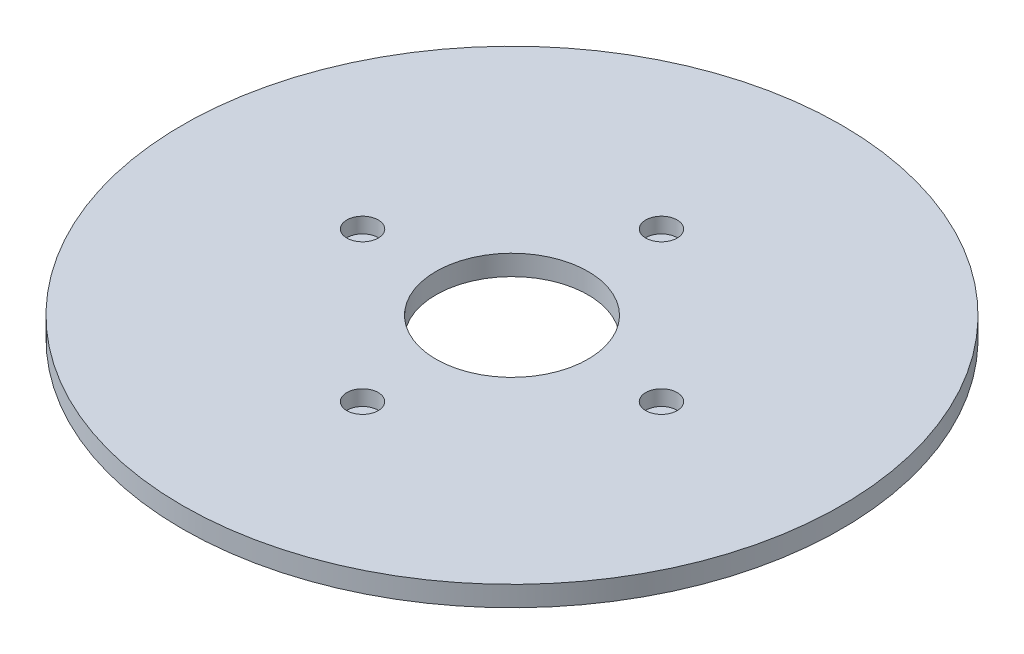
ISO-10303-21;
HEADER;
FILE_DESCRIPTION(('STEP AP214'),'2;1');
FILE_NAME('part.step','',(''),(''),'','','');
FILE_SCHEMA(('AUTOMOTIVE_DESIGN { 1 0 10303 214 1 1 1 1 }'));
ENDSEC;
DATA;
#1=APPLICATION_CONTEXT('core data for automotive mechanical design processes');
#2=APPLICATION_PROTOCOL_DEFINITION('international standard','automotive_design',2000,#1);
#3=PRODUCT_CONTEXT('',#1,'mechanical');
#4=PRODUCT('Part','Part','',(#3));
#5=PRODUCT_RELATED_PRODUCT_CATEGORY('part','',(#4));
#6=PRODUCT_DEFINITION_FORMATION('','',#4);
#7=PRODUCT_DEFINITION_CONTEXT('part definition',#1,'design');
#8=PRODUCT_DEFINITION('design','',#6,#7);
#9=PRODUCT_DEFINITION_SHAPE('','',#8);
#10=(LENGTH_UNIT() NAMED_UNIT(*) SI_UNIT(.MILLI.,.METRE.));
#11=(NAMED_UNIT(*) PLANE_ANGLE_UNIT() SI_UNIT($,.RADIAN.));
#12=(NAMED_UNIT(*) SI_UNIT($,.STERADIAN.) SOLID_ANGLE_UNIT());
#13=UNCERTAINTY_MEASURE_WITH_UNIT(LENGTH_MEASURE(1.E-05),#10,'distance_accuracy_value','');
#14=(GEOMETRIC_REPRESENTATION_CONTEXT(3) GLOBAL_UNCERTAINTY_ASSIGNED_CONTEXT((#13)) GLOBAL_UNIT_ASSIGNED_CONTEXT((#10,
#11,#12)) REPRESENTATION_CONTEXT('',''));
#15=CARTESIAN_POINT('',(0.,0.,0.));
#16=DIRECTION('',(0.,0.,1.));
#17=DIRECTION('',(1.,0.,0.));
#18=AXIS2_PLACEMENT_3D('',#15,#16,#17);
#19=CARTESIAN_POINT('',(0.,4.,0.));
#20=DIRECTION('',(0.,-1.,0.));
#21=DIRECTION('',(0.,0.,-1.));
#22=AXIS2_PLACEMENT_3D('',#19,#20,#21);
#23=CYLINDRICAL_SURFACE('',#22,65.);
#24=CARTESIAN_POINT('',(0.,4.,0.));
#25=DIRECTION('',(0.,1.,0.));
#26=DIRECTION('',(0.,0.,1.));
#27=AXIS2_PLACEMENT_3D('',#24,#25,#26);
#28=CIRCLE('',#27,65.);
#29=CARTESIAN_POINT('',(0.,4.,65.));
#30=VERTEX_POINT('',#29);
#31=EDGE_CURVE('E10',#30,#30,#28,.T.);
#32=ORIENTED_EDGE('',*,*,#31,.F.);
#33=EDGE_LOOP('',(#32));
#34=FACE_BOUND('',#33,.T.);
#35=CARTESIAN_POINT('',(0.,0.,0.));
#36=DIRECTION('',(0.,1.,0.));
#37=DIRECTION('',(0.,0.,1.));
#38=AXIS2_PLACEMENT_3D('',#35,#36,#37);
#39=CIRCLE('',#38,65.);
#40=CARTESIAN_POINT('',(0.,0.,65.));
#41=VERTEX_POINT('',#40);
#42=EDGE_CURVE('E37',#41,#41,#39,.T.);
#43=ORIENTED_EDGE('',*,*,#42,.T.);
#44=EDGE_LOOP('',(#43));
#45=FACE_BOUND('',#44,.T.);
#46=ADVANCED_FACE('F40',(#34,#45),#23,.T.);
#47=CARTESIAN_POINT('',(0.,4.,0.));
#48=DIRECTION('',(0.,1.,0.));
#49=DIRECTION('',(0.,0.,1.));
#50=AXIS2_PLACEMENT_3D('',#47,#48,#49);
#51=PLANE('',#50);
#52=CARTESIAN_POINT('',(1.02919290132673E-13,4.,29.4772562544395));
#53=DIRECTION('',(0.,1.,0.));
#54=DIRECTION('',(1.,0.,0.));
#55=AXIS2_PLACEMENT_3D('',#52,#53,#54);
#56=CIRCLE('',#55,3.09957946835279);
#57=CARTESIAN_POINT('',(3.09957946835289,4.,29.4772562544395));
#58=VERTEX_POINT('',#57);
#59=EDGE_CURVE('E71',#58,#58,#56,.T.);
#60=ORIENTED_EDGE('',*,*,#59,.F.);
#61=EDGE_LOOP('',(#60));
#62=FACE_BOUND('',#61,.T.);
#63=CARTESIAN_POINT('',(29.4772562544395,4.,0.));
#64=DIRECTION('',(0.,1.,0.));
#65=DIRECTION('',(0.,0.,-1.));
#66=AXIS2_PLACEMENT_3D('',#63,#64,#65);
#67=CIRCLE('',#66,3.09957946835279);
#68=CARTESIAN_POINT('',(29.4772562544395,4.,-3.09957946835279));
#69=VERTEX_POINT('',#68);
#70=EDGE_CURVE('E70',#69,#69,#67,.T.);
#71=ORIENTED_EDGE('',*,*,#70,.F.);
#72=EDGE_LOOP('',(#71));
#73=FACE_BOUND('',#72,.T.);
#74=CARTESIAN_POINT('',(-3.08757870398018E-13,4.,-29.4772562544395));
#75=DIRECTION('',(0.,1.,0.));
#76=DIRECTION('',(-1.,0.,0.));
#77=AXIS2_PLACEMENT_3D('',#74,#75,#76);
#78=CIRCLE('',#77,3.09957946835279);
#79=CARTESIAN_POINT('',(-3.0995794683531,4.,-29.4772562544395));
#80=VERTEX_POINT('',#79);
#81=EDGE_CURVE('E61',#80,#80,#78,.T.);
#82=ORIENTED_EDGE('',*,*,#81,.F.);
#83=EDGE_LOOP('',(#82));
#84=FACE_BOUND('',#83,.T.);
#85=CARTESIAN_POINT('',(-29.4772562544395,4.,0.));
#86=DIRECTION('',(0.,1.,0.));
#87=DIRECTION('',(0.,0.,1.));
#88=AXIS2_PLACEMENT_3D('',#85,#86,#87);
#89=CIRCLE('',#88,3.09957946835279);
#90=CARTESIAN_POINT('',(-29.4772562544395,4.,3.09957946835279));
#91=VERTEX_POINT('',#90);
#92=EDGE_CURVE('E54',#91,#91,#89,.T.);
#93=ORIENTED_EDGE('',*,*,#92,.F.);
#94=EDGE_LOOP('',(#93));
#95=FACE_BOUND('',#94,.T.);
#96=CARTESIAN_POINT('',(0.,4.,0.));
#97=DIRECTION('',(0.,1.,0.));
#98=DIRECTION('',(0.,0.,1.));
#99=AXIS2_PLACEMENT_3D('',#96,#97,#98);
#100=CIRCLE('',#99,15.);
#101=CARTESIAN_POINT('',(0.,4.,15.));
#102=VERTEX_POINT('',#101);
#103=EDGE_CURVE('E50',#102,#102,#100,.T.);
#104=ORIENTED_EDGE('',*,*,#103,.F.);
#105=EDGE_LOOP('',(#104));
#106=FACE_BOUND('',#105,.T.);
#107=ORIENTED_EDGE('',*,*,#31,.T.);
#108=EDGE_LOOP('',(#107));
#109=FACE_BOUND('',#108,.T.);
#110=ADVANCED_FACE('F86',(#62,#73,#84,#95,#106,#109),#51,.T.);
#111=CARTESIAN_POINT('',(0.,0.,0.));
#112=DIRECTION('',(0.,1.,0.));
#113=DIRECTION('',(0.,0.,1.));
#114=AXIS2_PLACEMENT_3D('',#111,#112,#113);
#115=PLANE('',#114);
#116=CARTESIAN_POINT('',(0.,0.,0.));
#117=DIRECTION('',(0.,1.,0.));
#118=DIRECTION('',(0.,0.,1.));
#119=AXIS2_PLACEMENT_3D('',#116,#117,#118);
#120=CIRCLE('',#119,15.);
#121=CARTESIAN_POINT('',(0.,0.,15.));
#122=VERTEX_POINT('',#121);
#123=EDGE_CURVE('E47',#122,#122,#120,.T.);
#124=ORIENTED_EDGE('',*,*,#123,.T.);
#125=EDGE_LOOP('',(#124));
#126=FACE_BOUND('',#125,.T.);
#127=ORIENTED_EDGE('',*,*,#42,.F.);
#128=EDGE_LOOP('',(#127));
#129=FACE_BOUND('',#128,.T.);
#130=ADVANCED_FACE('F93',(#126,#129),#115,.F.);
#131=CARTESIAN_POINT('',(0.,4.,0.));
#132=DIRECTION('',(0.,-1.,0.));
#133=DIRECTION('',(0.,0.,-1.));
#134=AXIS2_PLACEMENT_3D('',#131,#132,#133);
#135=CYLINDRICAL_SURFACE('',#134,15.);
#136=ORIENTED_EDGE('',*,*,#103,.T.);
#137=EDGE_LOOP('',(#136));
#138=FACE_BOUND('',#137,.T.);
#139=ORIENTED_EDGE('',*,*,#123,.F.);
#140=EDGE_LOOP('',(#139));
#141=FACE_BOUND('',#140,.T.);
#142=ADVANCED_FACE('F101',(#138,#141),#135,.F.);
#143=CARTESIAN_POINT('',(-29.4772562544395,0.969378735274113,0.));
#144=DIRECTION('',(0.,1.,0.));
#145=DIRECTION('',(0.,0.,1.));
#146=AXIS2_PLACEMENT_3D('',#143,#144,#145);
#147=CYLINDRICAL_SURFACE('',#146,3.09957946835279);
#148=CARTESIAN_POINT('',(-29.4772562544395,0.969378735274113,0.));
#149=DIRECTION('',(0.,1.,0.));
#150=DIRECTION('',(0.,0.,1.));
#151=AXIS2_PLACEMENT_3D('',#148,#149,#150);
#152=CIRCLE('',#151,3.09957946835279);
#153=CARTESIAN_POINT('',(-29.4772562544395,0.969378735274113,3.09957946835279));
#154=VERTEX_POINT('',#153);
#155=EDGE_CURVE('E55',#154,#154,#152,.T.);
#156=ORIENTED_EDGE('',*,*,#155,.F.);
#157=EDGE_LOOP('',(#156));
#158=FACE_BOUND('',#157,.T.);
#159=ORIENTED_EDGE('',*,*,#92,.T.);
#160=EDGE_LOOP('',(#159));
#161=FACE_BOUND('',#160,.T.);
#162=ADVANCED_FACE('F102',(#158,#161),#147,.F.);
#163=CARTESIAN_POINT('',(-29.4772562544395,0.969378735274113,0.));
#164=DIRECTION('',(0.,1.,0.));
#165=DIRECTION('',(0.,0.,1.));
#166=AXIS2_PLACEMENT_3D('',#163,#164,#165);
#167=PLANE('',#166);
#168=ORIENTED_EDGE('',*,*,#155,.T.);
#169=EDGE_LOOP('',(#168));
#170=FACE_BOUND('',#169,.T.);
#171=ADVANCED_FACE('F133',(#170),#167,.T.);
#172=CARTESIAN_POINT('',(-3.08757870398018E-13,0.969378735274113,-29.4772562544395));
#173=DIRECTION('',(0.,1.,0.));
#174=DIRECTION('',(0.,0.,1.));
#175=AXIS2_PLACEMENT_3D('',#172,#173,#174);
#176=CYLINDRICAL_SURFACE('',#175,3.09957946835279);
#177=CARTESIAN_POINT('',(-3.08757870398018E-13,0.969378735274113,-29.4772562544395));
#178=DIRECTION('',(0.,1.,0.));
#179=DIRECTION('',(-1.,0.,0.));
#180=AXIS2_PLACEMENT_3D('',#177,#178,#179);
#181=CIRCLE('',#180,3.09957946835279);
#182=CARTESIAN_POINT('',(-3.0995794683531,0.969378735274113,-29.4772562544395));
#183=VERTEX_POINT('',#182);
#184=EDGE_CURVE('E63',#183,#183,#181,.T.);
#185=ORIENTED_EDGE('',*,*,#184,.F.);
#186=EDGE_LOOP('',(#185));
#187=FACE_BOUND('',#186,.T.);
#188=ORIENTED_EDGE('',*,*,#81,.T.);
#189=EDGE_LOOP('',(#188));
#190=FACE_BOUND('',#189,.T.);
#191=ADVANCED_FACE('F142',(#187,#190),#176,.F.);
#192=CARTESIAN_POINT('',(-3.08757870398018E-13,0.969378735274113,-29.4772562544395));
#193=DIRECTION('',(0.,1.,0.));
#194=DIRECTION('',(-1.,0.,0.));
#195=AXIS2_PLACEMENT_3D('',#192,#193,#194);
#196=PLANE('',#195);
#197=ORIENTED_EDGE('',*,*,#184,.T.);
#198=EDGE_LOOP('',(#197));
#199=FACE_BOUND('',#198,.T.);
#200=ADVANCED_FACE('F156',(#199),#196,.T.);
#201=CARTESIAN_POINT('',(29.4772562544395,0.969378735274113,0.));
#202=DIRECTION('',(0.,1.,0.));
#203=DIRECTION('',(0.,0.,1.));
#204=AXIS2_PLACEMENT_3D('',#201,#202,#203);
#205=CYLINDRICAL_SURFACE('',#204,3.09957946835279);
#206=CARTESIAN_POINT('',(29.4772562544395,0.969378735274113,0.));
#207=DIRECTION('',(0.,1.,0.));
#208=DIRECTION('',(0.,0.,-1.));
#209=AXIS2_PLACEMENT_3D('',#206,#207,#208);
#210=CIRCLE('',#209,3.09957946835279);
#211=CARTESIAN_POINT('',(29.4772562544395,0.969378735274113,-3.09957946835279));
#212=VERTEX_POINT('',#211);
#213=EDGE_CURVE('E69',#212,#212,#210,.T.);
#214=ORIENTED_EDGE('',*,*,#213,.F.);
#215=EDGE_LOOP('',(#214));
#216=FACE_BOUND('',#215,.T.);
#217=ORIENTED_EDGE('',*,*,#70,.T.);
#218=EDGE_LOOP('',(#217));
#219=FACE_BOUND('',#218,.T.);
#220=ADVANCED_FACE('F164',(#216,#219),#205,.F.);
#221=CARTESIAN_POINT('',(29.4772562544395,0.969378735274113,0.));
#222=DIRECTION('',(0.,1.,0.));
#223=DIRECTION('',(0.,0.,-1.));
#224=AXIS2_PLACEMENT_3D('',#221,#222,#223);
#225=PLANE('',#224);
#226=ORIENTED_EDGE('',*,*,#213,.T.);
#227=EDGE_LOOP('',(#226));
#228=FACE_BOUND('',#227,.T.);
#229=ADVANCED_FACE('F83',(#228),#225,.T.);
#230=CARTESIAN_POINT('',(1.02919290132673E-13,0.969378735274113,29.4772562544395));
#231=DIRECTION('',(0.,1.,0.));
#232=DIRECTION('',(0.,0.,1.));
#233=AXIS2_PLACEMENT_3D('',#230,#231,#232);
#234=CYLINDRICAL_SURFACE('',#233,3.09957946835279);
#235=CARTESIAN_POINT('',(1.02919290132673E-13,0.969378735274113,29.4772562544395));
#236=DIRECTION('',(0.,1.,0.));
#237=DIRECTION('',(1.,0.,0.));
#238=AXIS2_PLACEMENT_3D('',#235,#236,#237);
#239=CIRCLE('',#238,3.09957946835279);
#240=CARTESIAN_POINT('',(3.09957946835289,0.969378735274113,29.4772562544395));
#241=VERTEX_POINT('',#240);
#242=EDGE_CURVE('E59',#241,#241,#239,.T.);
#243=ORIENTED_EDGE('',*,*,#242,.F.);
#244=EDGE_LOOP('',(#243));
#245=FACE_BOUND('',#244,.T.);
#246=ORIENTED_EDGE('',*,*,#59,.T.);
#247=EDGE_LOOP('',(#246));
#248=FACE_BOUND('',#247,.T.);
#249=ADVANCED_FACE('F81',(#245,#248),#234,.F.);
#250=CARTESIAN_POINT('',(1.02919290132673E-13,0.969378735274113,29.4772562544395));
#251=DIRECTION('',(0.,1.,0.));
#252=DIRECTION('',(1.,0.,0.));
#253=AXIS2_PLACEMENT_3D('',#250,#251,#252);
#254=PLANE('',#253);
#255=ORIENTED_EDGE('',*,*,#242,.T.);
#256=EDGE_LOOP('',(#255));
#257=FACE_BOUND('',#256,.T.);
#258=ADVANCED_FACE('F78',(#257),#254,.T.);
#259=CLOSED_SHELL('',(#46,#110,#130,#142,#162,#171,#191,#200,#220,#229,#249,#258));
#260=MANIFOLD_SOLID_BREP('B2',#259);
#261=ADVANCED_BREP_SHAPE_REPRESENTATION('',(#18,#260),#14);
#262=SHAPE_DEFINITION_REPRESENTATION(#9,#261);
ENDSEC;
END-ISO-10303-21;
